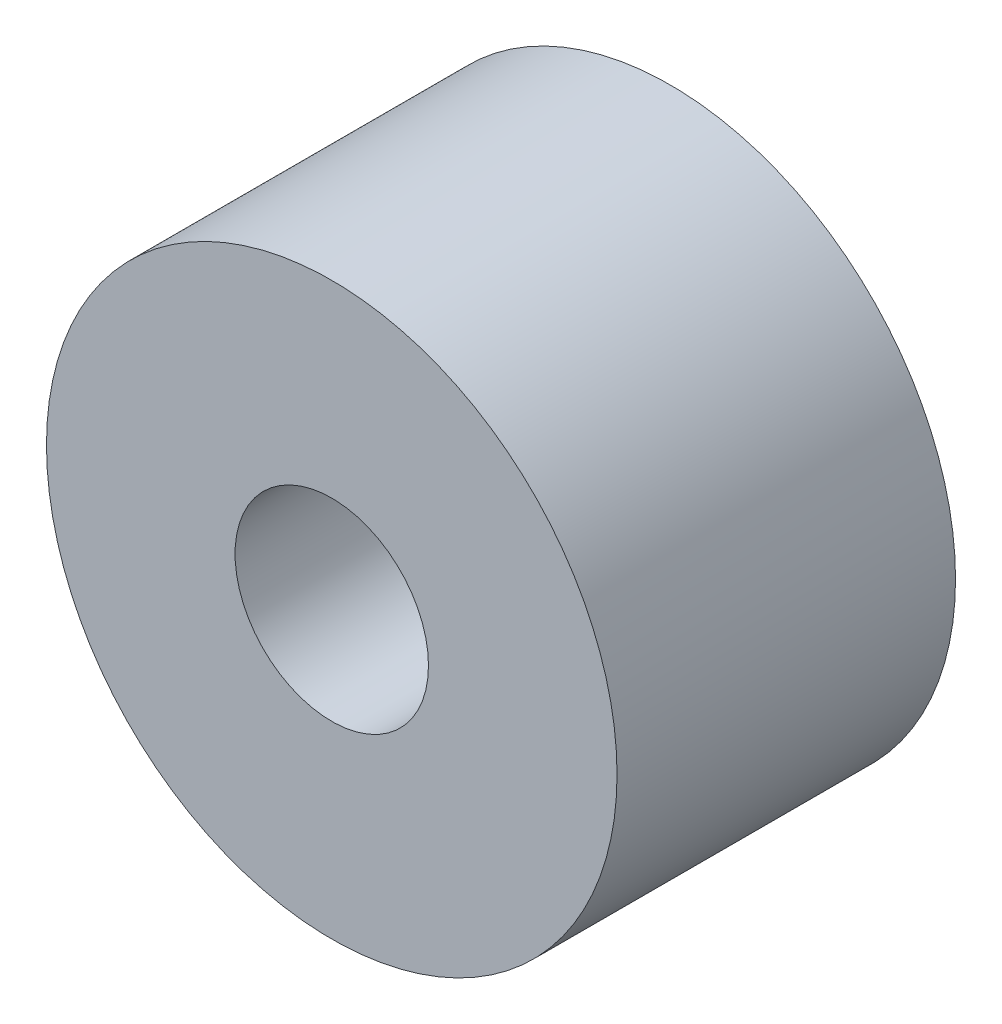
ISO-10303-21;
HEADER;
FILE_DESCRIPTION(('STEP AP214'),'2;1');
FILE_NAME('part.step','',(''),(''),'','','');
FILE_SCHEMA(('AUTOMOTIVE_DESIGN { 1 0 10303 214 1 1 1 1 }'));
ENDSEC;
DATA;
#1=APPLICATION_CONTEXT('core data for automotive mechanical design processes');
#2=APPLICATION_PROTOCOL_DEFINITION('international standard','automotive_design',2000,#1);
#3=PRODUCT_CONTEXT('',#1,'mechanical');
#4=PRODUCT('Part','Part','',(#3));
#5=PRODUCT_RELATED_PRODUCT_CATEGORY('part','',(#4));
#6=PRODUCT_DEFINITION_FORMATION('','',#4);
#7=PRODUCT_DEFINITION_CONTEXT('part definition',#1,'design');
#8=PRODUCT_DEFINITION('design','',#6,#7);
#9=PRODUCT_DEFINITION_SHAPE('','',#8);
#10=(LENGTH_UNIT() NAMED_UNIT(*) SI_UNIT(.MILLI.,.METRE.));
#11=(NAMED_UNIT(*) PLANE_ANGLE_UNIT() SI_UNIT($,.RADIAN.));
#12=(NAMED_UNIT(*) SI_UNIT($,.STERADIAN.) SOLID_ANGLE_UNIT());
#13=UNCERTAINTY_MEASURE_WITH_UNIT(LENGTH_MEASURE(1.E-05),#10,'distance_accuracy_value','');
#14=(GEOMETRIC_REPRESENTATION_CONTEXT(3) GLOBAL_UNCERTAINTY_ASSIGNED_CONTEXT((#13)) GLOBAL_UNIT_ASSIGNED_CONTEXT((#10,
#11,#12)) REPRESENTATION_CONTEXT('',''));
#15=CARTESIAN_POINT('',(0.,0.,0.));
#16=DIRECTION('',(0.,0.,1.));
#17=DIRECTION('',(1.,0.,0.));
#18=AXIS2_PLACEMENT_3D('',#15,#16,#17);
#19=CARTESIAN_POINT('',(0.,0.,-7.));
#20=DIRECTION('',(0.,0.,-1.));
#21=DIRECTION('',(1.,0.,0.));
#22=AXIS2_PLACEMENT_3D('',#19,#20,#21);
#23=PLANE('',#22);
#24=CARTESIAN_POINT('',(0.,0.,-7.));
#25=DIRECTION('',(0.,0.,1.));
#26=DIRECTION('',(1.,0.,0.));
#27=AXIS2_PLACEMENT_3D('',#24,#25,#26);
#28=CIRCLE('',#27,5.9);
#29=CARTESIAN_POINT('',(5.9,0.,-7.));
#30=VERTEX_POINT('',#29);
#31=EDGE_CURVE('E10',#30,#30,#28,.T.);
#32=ORIENTED_EDGE('',*,*,#31,.F.);
#33=EDGE_LOOP('',(#32));
#34=FACE_BOUND('',#33,.T.);
#35=CARTESIAN_POINT('',(0.,0.,-7.));
#36=DIRECTION('',(0.,0.,1.));
#37=DIRECTION('',(1.,0.,0.));
#38=AXIS2_PLACEMENT_3D('',#35,#36,#37);
#39=CIRCLE('',#38,2.);
#40=CARTESIAN_POINT('',(2.,0.,-7.));
#41=VERTEX_POINT('',#40);
#42=EDGE_CURVE('E46',#41,#41,#39,.T.);
#43=ORIENTED_EDGE('',*,*,#42,.T.);
#44=EDGE_LOOP('',(#43));
#45=FACE_BOUND('',#44,.T.);
#46=ADVANCED_FACE('F35',(#34,#45),#23,.T.);
#47=CARTESIAN_POINT('',(0.,0.,0.));
#48=DIRECTION('',(0.,0.,-1.));
#49=DIRECTION('',(1.,0.,0.));
#50=AXIS2_PLACEMENT_3D('',#47,#48,#49);
#51=PLANE('',#50);
#52=CARTESIAN_POINT('',(0.,0.,0.));
#53=DIRECTION('',(0.,0.,1.));
#54=DIRECTION('',(1.,0.,0.));
#55=AXIS2_PLACEMENT_3D('',#52,#53,#54);
#56=CIRCLE('',#55,5.9);
#57=CARTESIAN_POINT('',(5.9,0.,0.));
#58=VERTEX_POINT('',#57);
#59=EDGE_CURVE('E39',#58,#58,#56,.T.);
#60=ORIENTED_EDGE('',*,*,#59,.T.);
#61=EDGE_LOOP('',(#60));
#62=FACE_BOUND('',#61,.T.);
#63=CARTESIAN_POINT('',(0.,0.,0.));
#64=DIRECTION('',(0.,0.,1.));
#65=DIRECTION('',(1.,0.,0.));
#66=AXIS2_PLACEMENT_3D('',#63,#64,#65);
#67=CIRCLE('',#66,2.);
#68=CARTESIAN_POINT('',(2.,0.,0.));
#69=VERTEX_POINT('',#68);
#70=EDGE_CURVE('E48',#69,#69,#67,.T.);
#71=ORIENTED_EDGE('',*,*,#70,.F.);
#72=EDGE_LOOP('',(#71));
#73=FACE_BOUND('',#72,.T.);
#74=ADVANCED_FACE('F61',(#62,#73),#51,.F.);
#75=CARTESIAN_POINT('',(0.,0.,-7.));
#76=DIRECTION('',(0.,0.,1.));
#77=DIRECTION('',(-1.,0.,0.));
#78=AXIS2_PLACEMENT_3D('',#75,#76,#77);
#79=CYLINDRICAL_SURFACE('',#78,5.9);
#80=ORIENTED_EDGE('',*,*,#31,.T.);
#81=EDGE_LOOP('',(#80));
#82=FACE_BOUND('',#81,.T.);
#83=ORIENTED_EDGE('',*,*,#59,.F.);
#84=EDGE_LOOP('',(#83));
#85=FACE_BOUND('',#84,.T.);
#86=ADVANCED_FACE('F37',(#82,#85),#79,.T.);
#87=CARTESIAN_POINT('',(0.,0.,-7.));
#88=DIRECTION('',(0.,0.,1.));
#89=DIRECTION('',(-1.,0.,0.));
#90=AXIS2_PLACEMENT_3D('',#87,#88,#89);
#91=CYLINDRICAL_SURFACE('',#90,2.);
#92=ORIENTED_EDGE('',*,*,#42,.F.);
#93=EDGE_LOOP('',(#92));
#94=FACE_BOUND('',#93,.T.);
#95=ORIENTED_EDGE('',*,*,#70,.T.);
#96=EDGE_LOOP('',(#95));
#97=FACE_BOUND('',#96,.T.);
#98=ADVANCED_FACE('F55',(#94,#97),#91,.F.);
#99=CLOSED_SHELL('',(#46,#74,#86,#98));
#100=MANIFOLD_SOLID_BREP('B2',#99);
#101=ADVANCED_BREP_SHAPE_REPRESENTATION('',(#18,#100),#14);
#102=SHAPE_DEFINITION_REPRESENTATION(#9,#101);
ENDSEC;
END-ISO-10303-21;
